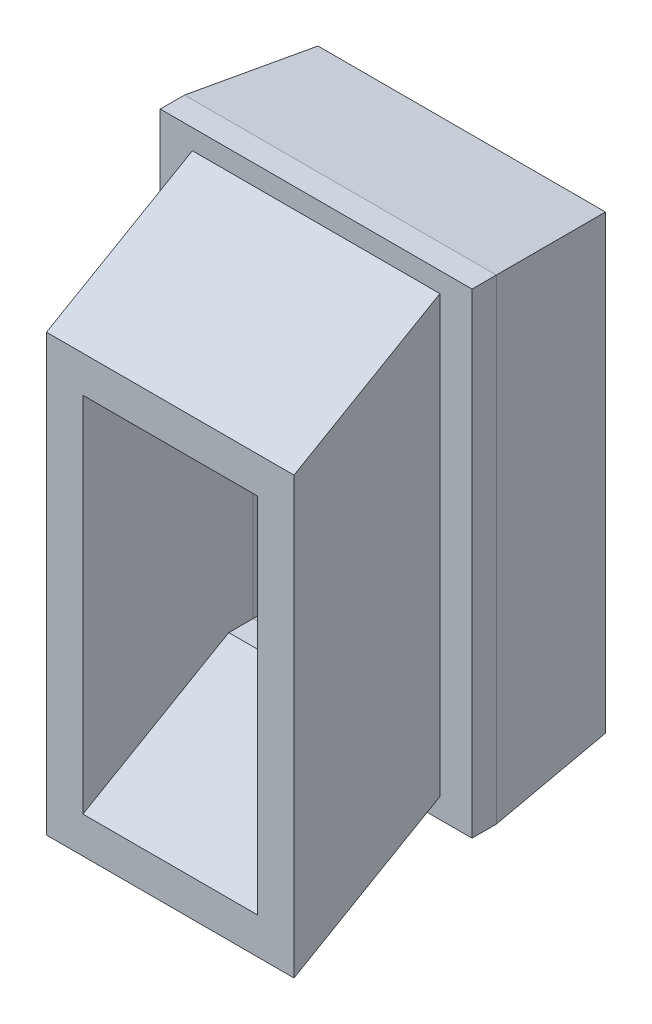
ISO-10303-21;
HEADER;
FILE_DESCRIPTION(('STEP AP214'),'2;1');
FILE_NAME('part.step','',(''),(''),'','','');
FILE_SCHEMA(('AUTOMOTIVE_DESIGN { 1 0 10303 214 1 1 1 1 }'));
ENDSEC;
DATA;
#1=APPLICATION_CONTEXT('core data for automotive mechanical design processes');
#2=APPLICATION_PROTOCOL_DEFINITION('international standard','automotive_design',2000,#1);
#3=PRODUCT_CONTEXT('',#1,'mechanical');
#4=PRODUCT('Part','Part','',(#3));
#5=PRODUCT_RELATED_PRODUCT_CATEGORY('part','',(#4));
#6=PRODUCT_DEFINITION_FORMATION('','',#4);
#7=PRODUCT_DEFINITION_CONTEXT('part definition',#1,'design');
#8=PRODUCT_DEFINITION('design','',#6,#7);
#9=PRODUCT_DEFINITION_SHAPE('','',#8);
#10=(LENGTH_UNIT() NAMED_UNIT(*) SI_UNIT(.MILLI.,.METRE.));
#11=(NAMED_UNIT(*) PLANE_ANGLE_UNIT() SI_UNIT($,.RADIAN.));
#12=(NAMED_UNIT(*) SI_UNIT($,.STERADIAN.) SOLID_ANGLE_UNIT());
#13=UNCERTAINTY_MEASURE_WITH_UNIT(LENGTH_MEASURE(1.E-05),#10,'distance_accuracy_value','');
#14=(GEOMETRIC_REPRESENTATION_CONTEXT(3) GLOBAL_UNCERTAINTY_ASSIGNED_CONTEXT((#13)) GLOBAL_UNIT_ASSIGNED_CONTEXT((#10,
#11,#12)) REPRESENTATION_CONTEXT('',''));
#15=CARTESIAN_POINT('',(0.,0.,0.));
#16=DIRECTION('',(0.,0.,1.));
#17=DIRECTION('',(1.,0.,0.));
#18=AXIS2_PLACEMENT_3D('',#15,#16,#17);
#19=CARTESIAN_POINT('',(0.,0.,12.));
#20=DIRECTION('',(0.,0.,-1.));
#21=DIRECTION('',(-1.,0.,0.));
#22=AXIS2_PLACEMENT_3D('',#19,#20,#21);
#23=PLANE('',#22);
#24=DIRECTION('',(0.,-1.,0.));
#25=VECTOR('',#24,1.);
#26=CARTESIAN_POINT('',(0.,0.,12.));
#27=LINE('',#26,#25);
#28=CARTESIAN_POINT('',(0.,39.2,12.));
#29=VERTEX_POINT('',#28);
#30=CARTESIAN_POINT('',(0.,0.,12.));
#31=VERTEX_POINT('',#30);
#32=EDGE_CURVE('E207',#29,#31,#27,.T.);
#33=ORIENTED_EDGE('',*,*,#32,.T.);
#34=DIRECTION('',(1.,0.,0.));
#35=VECTOR('',#34,1.);
#36=CARTESIAN_POINT('',(0.,0.,12.));
#37=LINE('',#36,#35);
#38=CARTESIAN_POINT('',(25.7,0.,12.));
#39=VERTEX_POINT('',#38);
#40=EDGE_CURVE('E210',#31,#39,#37,.T.);
#41=ORIENTED_EDGE('',*,*,#40,.T.);
#42=DIRECTION('',(0.,1.,0.));
#43=VECTOR('',#42,1.);
#44=CARTESIAN_POINT('',(25.7,0.,12.));
#45=LINE('',#44,#43);
#46=CARTESIAN_POINT('',(25.7,39.2,12.));
#47=VERTEX_POINT('',#46);
#48=EDGE_CURVE('E212',#39,#47,#45,.T.);
#49=ORIENTED_EDGE('',*,*,#48,.T.);
#50=DIRECTION('',(-1.,0.,0.));
#51=VECTOR('',#50,1.);
#52=CARTESIAN_POINT('',(0.,39.2,12.));
#53=LINE('',#52,#51);
#54=EDGE_CURVE('E214',#47,#29,#53,.T.);
#55=ORIENTED_EDGE('',*,*,#54,.T.);
#56=EDGE_LOOP('',(#33,#41,#49,#55));
#57=FACE_BOUND('',#56,.T.);
#58=DIRECTION('',(0.,-1.,0.));
#59=VECTOR('',#58,1.);
#60=CARTESIAN_POINT('',(2.64999999999999,1.65,12.));
#61=LINE('',#60,#59);
#62=CARTESIAN_POINT('',(2.64999999999999,37.55,12.));
#63=VERTEX_POINT('',#62);
#64=CARTESIAN_POINT('',(2.64999999999999,1.65,12.));
#65=VERTEX_POINT('',#64);
#66=EDGE_CURVE('E50',#63,#65,#61,.T.);
#67=ORIENTED_EDGE('',*,*,#66,.F.);
#68=DIRECTION('',(-1.,0.,0.));
#69=VECTOR('',#68,1.);
#70=CARTESIAN_POINT('',(2.64999999999999,37.55,12.));
#71=LINE('',#70,#69);
#72=CARTESIAN_POINT('',(23.05,37.55,12.));
#73=VERTEX_POINT('',#72);
#74=EDGE_CURVE('E54',#73,#63,#71,.T.);
#75=ORIENTED_EDGE('',*,*,#74,.F.);
#76=DIRECTION('',(0.,1.,0.));
#77=VECTOR('',#76,1.);
#78=CARTESIAN_POINT('',(23.05,37.55,12.));
#79=LINE('',#78,#77);
#80=CARTESIAN_POINT('',(23.05,1.65,12.));
#81=VERTEX_POINT('',#80);
#82=EDGE_CURVE('E562',#81,#73,#79,.T.);
#83=ORIENTED_EDGE('',*,*,#82,.F.);
#84=DIRECTION('',(1.,0.,0.));
#85=VECTOR('',#84,1.);
#86=CARTESIAN_POINT('',(2.64999999999999,1.65,12.));
#87=LINE('',#86,#85);
#88=EDGE_CURVE('E560',#65,#81,#87,.T.);
#89=ORIENTED_EDGE('',*,*,#88,.F.);
#90=EDGE_LOOP('',(#67,#75,#83,#89));
#91=FACE_BOUND('',#90,.T.);
#92=ADVANCED_FACE('F33',(#57,#91),#23,.F.);
#93=CARTESIAN_POINT('',(0.,0.,0.));
#94=DIRECTION('',(0.,0.,-1.));
#95=DIRECTION('',(-1.,0.,0.));
#96=AXIS2_PLACEMENT_3D('',#93,#94,#95);
#97=PLANE('',#96);
#98=DIRECTION('',(0.,-1.,0.));
#99=VECTOR('',#98,1.);
#100=CARTESIAN_POINT('',(4.64999999999999,0.,0.));
#101=LINE('',#100,#99);
#102=CARTESIAN_POINT('',(4.64999999999999,35.55,0.));
#103=VERTEX_POINT('',#102);
#104=CARTESIAN_POINT('',(4.64999999999999,3.65,0.));
#105=VERTEX_POINT('',#104);
#106=EDGE_CURVE('E237',#103,#105,#101,.T.);
#107=ORIENTED_EDGE('',*,*,#106,.T.);
#108=DIRECTION('',(1.,0.,0.));
#109=VECTOR('',#108,1.);
#110=CARTESIAN_POINT('',(0.,3.65,0.));
#111=LINE('',#110,#109);
#112=CARTESIAN_POINT('',(21.05,3.65,0.));
#113=VERTEX_POINT('',#112);
#114=EDGE_CURVE('E243',#105,#113,#111,.T.);
#115=ORIENTED_EDGE('',*,*,#114,.T.);
#116=DIRECTION('',(0.,1.,0.));
#117=VECTOR('',#116,1.);
#118=CARTESIAN_POINT('',(21.05,0.,0.));
#119=LINE('',#118,#117);
#120=CARTESIAN_POINT('',(21.05,35.55,0.));
#121=VERTEX_POINT('',#120);
#122=EDGE_CURVE('E241',#113,#121,#119,.T.);
#123=ORIENTED_EDGE('',*,*,#122,.T.);
#124=DIRECTION('',(-1.,0.,0.));
#125=VECTOR('',#124,1.);
#126=CARTESIAN_POINT('',(0.,35.55,0.));
#127=LINE('',#126,#125);
#128=EDGE_CURVE('E239',#121,#103,#127,.T.);
#129=ORIENTED_EDGE('',*,*,#128,.T.);
#130=EDGE_LOOP('',(#107,#115,#123,#129));
#131=FACE_BOUND('',#130,.T.);
#132=DIRECTION('',(1.,0.,0.));
#133=VECTOR('',#132,1.);
#134=CARTESIAN_POINT('',(25.7,38.2,0.));
#135=LINE('',#134,#133);
#136=CARTESIAN_POINT('',(0.999999999999997,38.2,0.));
#137=VERTEX_POINT('',#136);
#138=CARTESIAN_POINT('',(24.7,38.2,0.));
#139=VERTEX_POINT('',#138);
#140=EDGE_CURVE('E232',#137,#139,#135,.T.);
#141=ORIENTED_EDGE('',*,*,#140,.T.);
#142=DIRECTION('',(0.,-1.,0.));
#143=VECTOR('',#142,1.);
#144=CARTESIAN_POINT('',(24.7,0.,0.));
#145=LINE('',#144,#143);
#146=CARTESIAN_POINT('',(24.7,1.,0.));
#147=VERTEX_POINT('',#146);
#148=EDGE_CURVE('E234',#139,#147,#145,.T.);
#149=ORIENTED_EDGE('',*,*,#148,.T.);
#150=DIRECTION('',(-1.,0.,0.));
#151=VECTOR('',#150,1.);
#152=CARTESIAN_POINT('',(0.,1.,0.));
#153=LINE('',#152,#151);
#154=CARTESIAN_POINT('',(1.,1.,0.));
#155=VERTEX_POINT('',#154);
#156=EDGE_CURVE('E228',#147,#155,#153,.T.);
#157=ORIENTED_EDGE('',*,*,#156,.T.);
#158=DIRECTION('',(0.,1.,0.));
#159=VECTOR('',#158,1.);
#160=CARTESIAN_POINT('',(0.999999999999997,39.2,0.));
#161=LINE('',#160,#159);
#162=EDGE_CURVE('E230',#155,#137,#161,.T.);
#163=ORIENTED_EDGE('',*,*,#162,.T.);
#164=EDGE_LOOP('',(#141,#149,#157,#163));
#165=FACE_BOUND('',#164,.T.);
#166=ADVANCED_FACE('F291',(#131,#165),#97,.T.);
#167=CARTESIAN_POINT('',(0.,0.,12.));
#168=DIRECTION('',(1.,0.,0.));
#169=DIRECTION('',(0.,1.,0.));
#170=AXIS2_PLACEMENT_3D('',#167,#168,#169);
#171=PLANE('',#170);
#172=DIRECTION('',(0.,0.,-1.));
#173=VECTOR('',#172,1.);
#174=CARTESIAN_POINT('',(0.,39.2,12.));
#175=LINE('',#174,#173);
#176=CARTESIAN_POINT('',(0.,39.2,10.0000000000004));
#177=VERTEX_POINT('',#176);
#178=EDGE_CURVE('E216',#29,#177,#175,.T.);
#179=ORIENTED_EDGE('',*,*,#178,.T.);
#180=DIRECTION('',(0.,-1.,0.));
#181=VECTOR('',#180,1.);
#182=CARTESIAN_POINT('',(0.,0.,10.0000000000004));
#183=LINE('',#182,#181);
#184=CARTESIAN_POINT('',(0.,0.,10.0000000000004));
#185=VERTEX_POINT('',#184);
#186=EDGE_CURVE('E42',#177,#185,#183,.T.);
#187=ORIENTED_EDGE('',*,*,#186,.T.);
#188=DIRECTION('',(0.,0.,-1.));
#189=VECTOR('',#188,1.);
#190=CARTESIAN_POINT('',(0.,0.,12.));
#191=LINE('',#190,#189);
#192=EDGE_CURVE('E225',#31,#185,#191,.T.);
#193=ORIENTED_EDGE('',*,*,#192,.F.);
#194=ORIENTED_EDGE('',*,*,#32,.F.);
#195=EDGE_LOOP('',(#179,#187,#193,#194));
#196=FACE_BOUND('',#195,.T.);
#197=ADVANCED_FACE('F313',(#196),#171,.F.);
#198=CARTESIAN_POINT('',(0.,0.,12.));
#199=DIRECTION('',(0.,1.,0.));
#200=DIRECTION('',(0.,0.,1.));
#201=AXIS2_PLACEMENT_3D('',#198,#199,#200);
#202=PLANE('',#201);
#203=ORIENTED_EDGE('',*,*,#192,.T.);
#204=DIRECTION('',(1.,0.,0.));
#205=VECTOR('',#204,1.);
#206=CARTESIAN_POINT('',(25.7,0.,10.0000000000004));
#207=LINE('',#206,#205);
#208=CARTESIAN_POINT('',(25.7,0.,10.0000000000004));
#209=VERTEX_POINT('',#208);
#210=EDGE_CURVE('E11',#185,#209,#207,.T.);
#211=ORIENTED_EDGE('',*,*,#210,.T.);
#212=DIRECTION('',(0.,0.,-1.));
#213=VECTOR('',#212,1.);
#214=CARTESIAN_POINT('',(25.7,0.,12.));
#215=LINE('',#214,#213);
#216=EDGE_CURVE('E222',#39,#209,#215,.T.);
#217=ORIENTED_EDGE('',*,*,#216,.F.);
#218=ORIENTED_EDGE('',*,*,#40,.F.);
#219=EDGE_LOOP('',(#203,#211,#217,#218));
#220=FACE_BOUND('',#219,.T.);
#221=ADVANCED_FACE('F311',(#220),#202,.F.);
#222=CARTESIAN_POINT('',(25.7,0.,12.));
#223=DIRECTION('',(-1.,0.,0.));
#224=DIRECTION('',(0.,-1.,0.));
#225=AXIS2_PLACEMENT_3D('',#222,#223,#224);
#226=PLANE('',#225);
#227=ORIENTED_EDGE('',*,*,#216,.T.);
#228=DIRECTION('',(0.,1.,0.));
#229=VECTOR('',#228,1.);
#230=CARTESIAN_POINT('',(25.7,39.2,10.0000000000004));
#231=LINE('',#230,#229);
#232=CARTESIAN_POINT('',(25.7,39.2,10.0000000000004));
#233=VERTEX_POINT('',#232);
#234=EDGE_CURVE('E255',#209,#233,#231,.T.);
#235=ORIENTED_EDGE('',*,*,#234,.T.);
#236=DIRECTION('',(0.,0.,-1.));
#237=VECTOR('',#236,1.);
#238=CARTESIAN_POINT('',(25.7,39.2,12.));
#239=LINE('',#238,#237);
#240=EDGE_CURVE('E219',#47,#233,#239,.T.);
#241=ORIENTED_EDGE('',*,*,#240,.F.);
#242=ORIENTED_EDGE('',*,*,#48,.F.);
#243=EDGE_LOOP('',(#227,#235,#241,#242));
#244=FACE_BOUND('',#243,.T.);
#245=ADVANCED_FACE('F302',(#244),#226,.F.);
#246=CARTESIAN_POINT('',(0.,39.2,12.));
#247=DIRECTION('',(0.,-1.,0.));
#248=DIRECTION('',(0.,0.,-1.));
#249=AXIS2_PLACEMENT_3D('',#246,#247,#248);
#250=PLANE('',#249);
#251=ORIENTED_EDGE('',*,*,#240,.T.);
#252=DIRECTION('',(-1.,0.,0.));
#253=VECTOR('',#252,1.);
#254=CARTESIAN_POINT('',(0.,39.2,10.0000000000004));
#255=LINE('',#254,#253);
#256=EDGE_CURVE('E258',#233,#177,#255,.T.);
#257=ORIENTED_EDGE('',*,*,#256,.T.);
#258=ORIENTED_EDGE('',*,*,#178,.F.);
#259=ORIENTED_EDGE('',*,*,#54,.F.);
#260=EDGE_LOOP('',(#251,#257,#258,#259));
#261=FACE_BOUND('',#260,.T.);
#262=ADVANCED_FACE('F306',(#261),#250,.F.);
#263=CARTESIAN_POINT('',(5.64999999999999,4.65,12.));
#264=DIRECTION('',(1.,0.,0.));
#265=DIRECTION('',(0.,0.,-1.));
#266=AXIS2_PLACEMENT_3D('',#263,#264,#265);
#267=PLANE('',#266);
#268=DIRECTION('',(0.,0.,-1.));
#269=VECTOR('',#268,1.);
#270=CARTESIAN_POINT('',(5.64999999999999,4.65,12.));
#271=LINE('',#270,#269);
#272=CARTESIAN_POINT('',(5.64999999999999,4.65,12.));
#273=VERTEX_POINT('',#272);
#274=CARTESIAN_POINT('',(5.64999999999999,4.65,10.));
#275=VERTEX_POINT('',#274);
#276=EDGE_CURVE('E204',#273,#275,#271,.T.);
#277=ORIENTED_EDGE('',*,*,#276,.T.);
#278=DIRECTION('',(0.,1.,0.));
#279=VECTOR('',#278,1.);
#280=CARTESIAN_POINT('',(5.64999999999999,4.65,10.));
#281=LINE('',#280,#279);
#282=CARTESIAN_POINT('',(5.64999999999999,34.55,10.));
#283=VERTEX_POINT('',#282);
#284=EDGE_CURVE('E253',#275,#283,#281,.T.);
#285=ORIENTED_EDGE('',*,*,#284,.T.);
#286=DIRECTION('',(0.,0.,-1.));
#287=VECTOR('',#286,1.);
#288=CARTESIAN_POINT('',(5.64999999999999,34.55,12.));
#289=LINE('',#288,#287);
#290=CARTESIAN_POINT('',(5.64999999999999,34.55,12.));
#291=VERTEX_POINT('',#290);
#292=EDGE_CURVE('E195',#291,#283,#289,.T.);
#293=ORIENTED_EDGE('',*,*,#292,.F.);
#294=DIRECTION('',(0.,0.500000000000004,-0.866025403784436));
#295=VECTOR('',#294,1.);
#296=CARTESIAN_POINT('',(5.64999999999999,27.6077863452328,24.024266767055));
#297=LINE('',#296,#295);
#298=CARTESIAN_POINT('',(5.64999999999999,27.6077863452328,24.024266767055));
#299=VERTEX_POINT('',#298);
#300=EDGE_CURVE('E180',#299,#291,#297,.T.);
#301=ORIENTED_EDGE('',*,*,#300,.F.);
#302=DIRECTION('',(0.,-1.,0.));
#303=VECTOR('',#302,1.);
#304=CARTESIAN_POINT('',(5.64999999999999,-2.29221365476717,24.024266767055));
#305=LINE('',#304,#303);
#306=CARTESIAN_POINT('',(5.64999999999999,-2.29221365476717,24.024266767055));
#307=VERTEX_POINT('',#306);
#308=EDGE_CURVE('E548',#299,#307,#305,.T.);
#309=ORIENTED_EDGE('',*,*,#308,.T.);
#310=DIRECTION('',(0.,0.500000000000004,-0.866025403784436));
#311=VECTOR('',#310,1.);
#312=CARTESIAN_POINT('',(5.64999999999999,-2.29221365476717,24.024266767055));
#313=LINE('',#312,#311);
#314=EDGE_CURVE('E182',#307,#273,#313,.T.);
#315=ORIENTED_EDGE('',*,*,#314,.T.);
#316=EDGE_LOOP('',(#277,#285,#293,#301,#309,#315));
#317=FACE_BOUND('',#316,.T.);
#318=ADVANCED_FACE('F331',(#317),#267,.T.);
#319=CARTESIAN_POINT('',(5.64999999999999,4.65,12.));
#320=DIRECTION('',(0.,1.,0.));
#321=DIRECTION('',(0.,0.,1.));
#322=AXIS2_PLACEMENT_3D('',#319,#320,#321);
#323=PLANE('',#322);
#324=DIRECTION('',(0.,0.,-1.));
#325=VECTOR('',#324,1.);
#326=CARTESIAN_POINT('',(20.05,4.65,12.));
#327=LINE('',#326,#325);
#328=CARTESIAN_POINT('',(20.05,4.65,12.));
#329=VERTEX_POINT('',#328);
#330=CARTESIAN_POINT('',(20.05,4.65,10.));
#331=VERTEX_POINT('',#330);
#332=EDGE_CURVE('E201',#329,#331,#327,.T.);
#333=ORIENTED_EDGE('',*,*,#332,.T.);
#334=DIRECTION('',(-1.,0.,0.));
#335=VECTOR('',#334,1.);
#336=CARTESIAN_POINT('',(5.64999999999999,4.65,10.));
#337=LINE('',#336,#335);
#338=EDGE_CURVE('E246',#331,#275,#337,.T.);
#339=ORIENTED_EDGE('',*,*,#338,.T.);
#340=ORIENTED_EDGE('',*,*,#276,.F.);
#341=DIRECTION('',(1.,0.,0.));
#342=VECTOR('',#341,1.);
#343=CARTESIAN_POINT('',(5.64999999999999,4.65,12.));
#344=LINE('',#343,#342);
#345=EDGE_CURVE('E188',#273,#329,#344,.T.);
#346=ORIENTED_EDGE('',*,*,#345,.T.);
#347=EDGE_LOOP('',(#333,#339,#340,#346));
#348=FACE_BOUND('',#347,.T.);
#349=ADVANCED_FACE('F491',(#348),#323,.T.);
#350=CARTESIAN_POINT('',(20.05,4.65,12.));
#351=DIRECTION('',(-1.,0.,0.));
#352=DIRECTION('',(0.,0.,1.));
#353=AXIS2_PLACEMENT_3D('',#350,#351,#352);
#354=PLANE('',#353);
#355=DIRECTION('',(0.,0.,-1.));
#356=VECTOR('',#355,1.);
#357=CARTESIAN_POINT('',(20.05,34.55,12.));
#358=LINE('',#357,#356);
#359=CARTESIAN_POINT('',(20.05,34.55,12.));
#360=VERTEX_POINT('',#359);
#361=CARTESIAN_POINT('',(20.05,34.55,10.));
#362=VERTEX_POINT('',#361);
#363=EDGE_CURVE('E198',#360,#362,#358,.T.);
#364=ORIENTED_EDGE('',*,*,#363,.T.);
#365=DIRECTION('',(0.,-1.,0.));
#366=VECTOR('',#365,1.);
#367=CARTESIAN_POINT('',(20.05,4.65,10.));
#368=LINE('',#367,#366);
#369=EDGE_CURVE('E249',#362,#331,#368,.T.);
#370=ORIENTED_EDGE('',*,*,#369,.T.);
#371=ORIENTED_EDGE('',*,*,#332,.F.);
#372=DIRECTION('',(0.,0.500000000000004,-0.866025403784436));
#373=VECTOR('',#372,1.);
#374=CARTESIAN_POINT('',(20.05,-2.29221365476717,24.024266767055));
#375=LINE('',#374,#373);
#376=CARTESIAN_POINT('',(20.05,-2.29221365476717,24.024266767055));
#377=VERTEX_POINT('',#376);
#378=EDGE_CURVE('E566',#377,#329,#375,.T.);
#379=ORIENTED_EDGE('',*,*,#378,.F.);
#380=DIRECTION('',(0.,1.,0.));
#381=VECTOR('',#380,1.);
#382=CARTESIAN_POINT('',(20.05,27.6077863452328,24.024266767055));
#383=LINE('',#382,#381);
#384=CARTESIAN_POINT('',(20.05,27.6077863452328,24.024266767055));
#385=VERTEX_POINT('',#384);
#386=EDGE_CURVE('E555',#377,#385,#383,.T.);
#387=ORIENTED_EDGE('',*,*,#386,.T.);
#388=DIRECTION('',(0.,0.500000000000004,-0.866025403784436));
#389=VECTOR('',#388,1.);
#390=CARTESIAN_POINT('',(20.05,27.6077863452328,24.024266767055));
#391=LINE('',#390,#389);
#392=EDGE_CURVE('E273',#385,#360,#391,.T.);
#393=ORIENTED_EDGE('',*,*,#392,.T.);
#394=EDGE_LOOP('',(#364,#370,#371,#379,#387,#393));
#395=FACE_BOUND('',#394,.T.);
#396=ADVANCED_FACE('F485',(#395),#354,.T.);
#397=CARTESIAN_POINT('',(5.64999999999999,34.55,12.));
#398=DIRECTION('',(0.,-1.,0.));
#399=DIRECTION('',(0.,0.,-1.));
#400=AXIS2_PLACEMENT_3D('',#397,#398,#399);
#401=PLANE('',#400);
#402=ORIENTED_EDGE('',*,*,#292,.T.);
#403=DIRECTION('',(1.,0.,0.));
#404=VECTOR('',#403,1.);
#405=CARTESIAN_POINT('',(5.64999999999999,34.55,10.));
#406=LINE('',#405,#404);
#407=EDGE_CURVE('E251',#283,#362,#406,.T.);
#408=ORIENTED_EDGE('',*,*,#407,.T.);
#409=ORIENTED_EDGE('',*,*,#363,.F.);
#410=DIRECTION('',(-1.,0.,0.));
#411=VECTOR('',#410,1.);
#412=CARTESIAN_POINT('',(5.64999999999999,34.55,12.));
#413=LINE('',#412,#411);
#414=EDGE_CURVE('E191',#360,#291,#413,.T.);
#415=ORIENTED_EDGE('',*,*,#414,.T.);
#416=EDGE_LOOP('',(#402,#408,#409,#415));
#417=FACE_BOUND('',#416,.T.);
#418=ADVANCED_FACE('F355',(#417),#401,.T.);
#419=CARTESIAN_POINT('',(0.,35.55,0.));
#420=DIRECTION('',(0.,0.995037190209989,0.099503719020999));
#421=DIRECTION('',(-1.,0.,0.));
#422=AXIS2_PLACEMENT_3D('',#419,#420,#421);
#423=PLANE('',#422);
#424=DIRECTION('',(-0.0990147542976675,-0.0990147542976675,0.990147542976675));
#425=VECTOR('',#424,1.);
#426=CARTESIAN_POINT('',(20.7014705882353,35.2014705882353,3.48529411764706));
#427=LINE('',#426,#425);
#428=EDGE_CURVE('E265',#362,#121,#427,.F.);
#429=ORIENTED_EDGE('',*,*,#428,.F.);
#430=ORIENTED_EDGE('',*,*,#407,.F.);
#431=DIRECTION('',(0.0990147542976675,-0.0990147542976675,0.990147542976675));
#432=VECTOR('',#431,1.);
#433=CARTESIAN_POINT('',(4.60441176470588,35.5955882352941,-0.455882352941176));
#434=LINE('',#433,#432);
#435=EDGE_CURVE('E192',#103,#283,#434,.T.);
#436=ORIENTED_EDGE('',*,*,#435,.F.);
#437=ORIENTED_EDGE('',*,*,#128,.F.);
#438=EDGE_LOOP('',(#429,#430,#436,#437));
#439=FACE_BOUND('',#438,.T.);
#440=ADVANCED_FACE('F349',(#439),#423,.F.);
#441=CARTESIAN_POINT('',(4.64999999999999,0.,0.));
#442=DIRECTION('',(-0.995037190209989,0.,0.0995037190209989));
#443=DIRECTION('',(0.,-1.,0.));
#444=AXIS2_PLACEMENT_3D('',#441,#442,#443);
#445=PLANE('',#444);
#446=ORIENTED_EDGE('',*,*,#435,.T.);
#447=ORIENTED_EDGE('',*,*,#284,.F.);
#448=DIRECTION('',(-0.0990147542976675,-0.0990147542976675,-0.990147542976675));
#449=VECTOR('',#448,1.);
#450=CARTESIAN_POINT('',(4.60441176470588,3.60441176470588,-0.455882352941176));
#451=LINE('',#450,#449);
#452=EDGE_CURVE('E263',#105,#275,#451,.F.);
#453=ORIENTED_EDGE('',*,*,#452,.F.);
#454=ORIENTED_EDGE('',*,*,#106,.F.);
#455=EDGE_LOOP('',(#446,#447,#453,#454));
#456=FACE_BOUND('',#455,.T.);
#457=ADVANCED_FACE('F354',(#456),#445,.F.);
#458=CARTESIAN_POINT('',(21.05,0.,0.));
#459=DIRECTION('',(0.995037190209989,0.,0.099503719020999));
#460=DIRECTION('',(0.,1.,0.));
#461=AXIS2_PLACEMENT_3D('',#458,#459,#460);
#462=PLANE('',#461);
#463=ORIENTED_EDGE('',*,*,#428,.T.);
#464=ORIENTED_EDGE('',*,*,#122,.F.);
#465=DIRECTION('',(-0.0990147542976675,0.0990147542976675,0.990147542976675));
#466=VECTOR('',#465,1.);
#467=CARTESIAN_POINT('',(20.8436274509804,3.85637254901961,2.06372549019608));
#468=LINE('',#467,#466);
#469=EDGE_CURVE('E261',#331,#113,#468,.F.);
#470=ORIENTED_EDGE('',*,*,#469,.F.);
#471=ORIENTED_EDGE('',*,*,#369,.F.);
#472=EDGE_LOOP('',(#463,#464,#470,#471));
#473=FACE_BOUND('',#472,.T.);
#474=ADVANCED_FACE('F367',(#473),#462,.F.);
#475=CARTESIAN_POINT('',(0.,3.65,0.));
#476=DIRECTION('',(0.,-0.995037190209989,0.0995037190209989));
#477=DIRECTION('',(1.,0.,0.));
#478=AXIS2_PLACEMENT_3D('',#475,#476,#477);
#479=PLANE('',#478);
#480=ORIENTED_EDGE('',*,*,#452,.T.);
#481=ORIENTED_EDGE('',*,*,#338,.F.);
#482=ORIENTED_EDGE('',*,*,#469,.T.);
#483=ORIENTED_EDGE('',*,*,#114,.F.);
#484=EDGE_LOOP('',(#480,#481,#482,#483));
#485=FACE_BOUND('',#484,.T.);
#486=ADVANCED_FACE('F377',(#485),#479,.F.);
#487=CARTESIAN_POINT('',(0.,0.,10.0000000000004));
#488=DIRECTION('',(-0.995037190209989,0.,-0.0995037190209955));
#489=DIRECTION('',(0.,1.,0.));
#490=AXIS2_PLACEMENT_3D('',#487,#488,#489);
#491=PLANE('',#490);
#492=DIRECTION('',(0.0990147542976641,-0.0990147542976641,-0.990147542976675));
#493=VECTOR('',#492,1.);
#494=CARTESIAN_POINT('',(0.384313725490167,38.8156862745098,6.15686274509852));
#495=LINE('',#494,#493);
#496=EDGE_CURVE('E274',#137,#177,#495,.F.);
#497=ORIENTED_EDGE('',*,*,#496,.F.);
#498=ORIENTED_EDGE('',*,*,#162,.F.);
#499=DIRECTION('',(0.0990147542976641,0.0990147542976641,-0.990147542976675));
#500=VECTOR('',#499,1.);
#501=CARTESIAN_POINT('',(0.,0.,10.0000000000004));
#502=LINE('',#501,#500);
#503=EDGE_CURVE('E37',#185,#155,#502,.T.);
#504=ORIENTED_EDGE('',*,*,#503,.F.);
#505=ORIENTED_EDGE('',*,*,#186,.F.);
#506=EDGE_LOOP('',(#497,#498,#504,#505));
#507=FACE_BOUND('',#506,.T.);
#508=ADVANCED_FACE('F35',(#507),#491,.T.);
#509=CARTESIAN_POINT('',(0.,0.,10.0000000000004));
#510=DIRECTION('',(0.,-0.995037190209989,-0.0995037190209955));
#511=DIRECTION('',(-1.,0.,0.));
#512=AXIS2_PLACEMENT_3D('',#509,#510,#511);
#513=PLANE('',#512);
#514=ORIENTED_EDGE('',*,*,#503,.T.);
#515=ORIENTED_EDGE('',*,*,#156,.F.);
#516=DIRECTION('',(0.0990147542976641,-0.0990147542976641,0.990147542976675));
#517=VECTOR('',#516,1.);
#518=CARTESIAN_POINT('',(25.4480392156863,0.251960784313708,7.48039215686318));
#519=LINE('',#518,#517);
#520=EDGE_CURVE('E272',#209,#147,#519,.F.);
#521=ORIENTED_EDGE('',*,*,#520,.F.);
#522=ORIENTED_EDGE('',*,*,#210,.F.);
#523=EDGE_LOOP('',(#514,#515,#521,#522));
#524=FACE_BOUND('',#523,.T.);
#525=ADVANCED_FACE('F285',(#524),#513,.T.);
#526=CARTESIAN_POINT('',(0.,39.2,10.0000000000004));
#527=DIRECTION('',(0.,0.995037190209989,-0.0995037190209955));
#528=DIRECTION('',(1.,0.,0.));
#529=AXIS2_PLACEMENT_3D('',#526,#527,#528);
#530=PLANE('',#529);
#531=ORIENTED_EDGE('',*,*,#496,.T.);
#532=ORIENTED_EDGE('',*,*,#256,.F.);
#533=DIRECTION('',(-0.0990147542976641,-0.0990147542976641,-0.990147542976675));
#534=VECTOR('',#533,1.);
#535=CARTESIAN_POINT('',(25.4480392156863,38.9480392156863,7.48039215686319));
#536=LINE('',#535,#534);
#537=EDGE_CURVE('E270',#139,#233,#536,.F.);
#538=ORIENTED_EDGE('',*,*,#537,.F.);
#539=ORIENTED_EDGE('',*,*,#140,.F.);
#540=EDGE_LOOP('',(#531,#532,#538,#539));
#541=FACE_BOUND('',#540,.T.);
#542=ADVANCED_FACE('F297',(#541),#530,.T.);
#543=CARTESIAN_POINT('',(25.7,0.,10.0000000000004));
#544=DIRECTION('',(0.995037190209989,0.,-0.0995037190209955));
#545=DIRECTION('',(0.,-1.,0.));
#546=AXIS2_PLACEMENT_3D('',#543,#544,#545);
#547=PLANE('',#546);
#548=ORIENTED_EDGE('',*,*,#520,.T.);
#549=ORIENTED_EDGE('',*,*,#148,.F.);
#550=ORIENTED_EDGE('',*,*,#537,.T.);
#551=ORIENTED_EDGE('',*,*,#234,.F.);
#552=EDGE_LOOP('',(#548,#549,#550,#551));
#553=FACE_BOUND('',#552,.T.);
#554=ADVANCED_FACE('F295',(#553),#547,.T.);
#555=CARTESIAN_POINT('',(5.64999999999999,27.6077863452328,24.024266767055));
#556=DIRECTION('',(0.,-0.866025403784436,-0.500000000000004));
#557=DIRECTION('',(0.,0.500000000000004,-0.866025403784436));
#558=AXIS2_PLACEMENT_3D('',#555,#556,#557);
#559=PLANE('',#558);
#560=ORIENTED_EDGE('',*,*,#414,.F.);
#561=ORIENTED_EDGE('',*,*,#392,.F.);
#562=DIRECTION('',(-1.,0.,0.));
#563=VECTOR('',#562,1.);
#564=CARTESIAN_POINT('',(5.64999999999999,27.6077863452328,24.024266767055));
#565=LINE('',#564,#563);
#566=EDGE_CURVE('E545',#385,#299,#565,.T.);
#567=ORIENTED_EDGE('',*,*,#566,.T.);
#568=ORIENTED_EDGE('',*,*,#300,.T.);
#569=EDGE_LOOP('',(#560,#561,#567,#568));
#570=FACE_BOUND('',#569,.T.);
#571=ADVANCED_FACE('F415',(#570),#559,.T.);
#572=CARTESIAN_POINT('',(20.05,-2.29221365476717,24.024266767055));
#573=DIRECTION('',(0.,0.866025403784436,0.500000000000004));
#574=DIRECTION('',(0.,-0.500000000000004,0.866025403784436));
#575=AXIS2_PLACEMENT_3D('',#572,#573,#574);
#576=PLANE('',#575);
#577=ORIENTED_EDGE('',*,*,#345,.F.);
#578=ORIENTED_EDGE('',*,*,#314,.F.);
#579=DIRECTION('',(1.,0.,0.));
#580=VECTOR('',#579,1.);
#581=CARTESIAN_POINT('',(20.05,-2.29221365476717,24.024266767055));
#582=LINE('',#581,#580);
#583=EDGE_CURVE('E551',#307,#377,#582,.T.);
#584=ORIENTED_EDGE('',*,*,#583,.T.);
#585=ORIENTED_EDGE('',*,*,#378,.T.);
#586=EDGE_LOOP('',(#577,#578,#584,#585));
#587=FACE_BOUND('',#586,.T.);
#588=ADVANCED_FACE('F424',(#587),#576,.T.);
#589=CARTESIAN_POINT('',(2.64999999999999,-5.29221365476717,24.024266767055));
#590=DIRECTION('',(1.,0.,0.));
#591=DIRECTION('',(0.,0.,-1.));
#592=AXIS2_PLACEMENT_3D('',#589,#590,#591);
#593=PLANE('',#592);
#594=ORIENTED_EDGE('',*,*,#66,.T.);
#595=DIRECTION('',(0.,0.500000000000004,-0.866025403784436));
#596=VECTOR('',#595,1.);
#597=CARTESIAN_POINT('',(2.64999999999999,-5.29221365476717,24.024266767055));
#598=LINE('',#597,#596);
#599=CARTESIAN_POINT('',(2.64999999999999,-5.29221365476717,24.024266767055));
#600=VERTEX_POINT('',#599);
#601=EDGE_CURVE('E162',#600,#65,#598,.T.);
#602=ORIENTED_EDGE('',*,*,#601,.F.);
#603=DIRECTION('',(0.,-1.,0.));
#604=VECTOR('',#603,1.);
#605=CARTESIAN_POINT('',(2.64999999999999,-5.29221365476717,24.024266767055));
#606=LINE('',#605,#604);
#607=CARTESIAN_POINT('',(2.64999999999999,30.6077863452328,24.024266767055));
#608=VERTEX_POINT('',#607);
#609=EDGE_CURVE('E168',#608,#600,#606,.T.);
#610=ORIENTED_EDGE('',*,*,#609,.F.);
#611=DIRECTION('',(0.,0.500000000000004,-0.866025403784436));
#612=VECTOR('',#611,1.);
#613=CARTESIAN_POINT('',(2.64999999999999,30.6077863452328,24.024266767055));
#614=LINE('',#613,#612);
#615=EDGE_CURVE('E550',#608,#63,#614,.T.);
#616=ORIENTED_EDGE('',*,*,#615,.T.);
#617=EDGE_LOOP('',(#594,#602,#610,#616));
#618=FACE_BOUND('',#617,.T.);
#619=ADVANCED_FACE('F179',(#618),#593,.F.);
#620=CARTESIAN_POINT('',(2.64999999999999,-5.29221365476717,24.024266767055));
#621=DIRECTION('',(0.,0.866025403784436,0.500000000000004));
#622=DIRECTION('',(0.,-0.500000000000004,0.866025403784436));
#623=AXIS2_PLACEMENT_3D('',#620,#621,#622);
#624=PLANE('',#623);
#625=ORIENTED_EDGE('',*,*,#88,.T.);
#626=DIRECTION('',(0.,0.500000000000004,-0.866025403784436));
#627=VECTOR('',#626,1.);
#628=CARTESIAN_POINT('',(23.05,-5.29221365476717,24.024266767055));
#629=LINE('',#628,#627);
#630=CARTESIAN_POINT('',(23.05,-5.29221365476717,24.024266767055));
#631=VERTEX_POINT('',#630);
#632=EDGE_CURVE('E164',#631,#81,#629,.T.);
#633=ORIENTED_EDGE('',*,*,#632,.F.);
#634=DIRECTION('',(1.,0.,0.));
#635=VECTOR('',#634,1.);
#636=CARTESIAN_POINT('',(2.64999999999999,-5.29221365476717,24.024266767055));
#637=LINE('',#636,#635);
#638=EDGE_CURVE('E157',#600,#631,#637,.T.);
#639=ORIENTED_EDGE('',*,*,#638,.F.);
#640=ORIENTED_EDGE('',*,*,#601,.T.);
#641=EDGE_LOOP('',(#625,#633,#639,#640));
#642=FACE_BOUND('',#641,.T.);
#643=ADVANCED_FACE('F160',(#642),#624,.F.);
#644=CARTESIAN_POINT('',(23.05,30.6077863452328,24.024266767055));
#645=DIRECTION('',(-1.,0.,0.));
#646=DIRECTION('',(0.,-1.,0.));
#647=AXIS2_PLACEMENT_3D('',#644,#645,#646);
#648=PLANE('',#647);
#649=ORIENTED_EDGE('',*,*,#82,.T.);
#650=DIRECTION('',(0.,0.500000000000004,-0.866025403784436));
#651=VECTOR('',#650,1.);
#652=CARTESIAN_POINT('',(23.05,30.6077863452328,24.024266767055));
#653=LINE('',#652,#651);
#654=CARTESIAN_POINT('',(23.05,30.6077863452328,24.024266767055));
#655=VERTEX_POINT('',#654);
#656=EDGE_CURVE('E184',#655,#73,#653,.T.);
#657=ORIENTED_EDGE('',*,*,#656,.F.);
#658=DIRECTION('',(0.,1.,0.));
#659=VECTOR('',#658,1.);
#660=CARTESIAN_POINT('',(23.05,30.6077863452328,24.024266767055));
#661=LINE('',#660,#659);
#662=EDGE_CURVE('E167',#631,#655,#661,.T.);
#663=ORIENTED_EDGE('',*,*,#662,.F.);
#664=ORIENTED_EDGE('',*,*,#632,.T.);
#665=EDGE_LOOP('',(#649,#657,#663,#664));
#666=FACE_BOUND('',#665,.T.);
#667=ADVANCED_FACE('F446',(#666),#648,.F.);
#668=CARTESIAN_POINT('',(2.64999999999999,30.6077863452328,24.024266767055));
#669=DIRECTION('',(0.,-0.866025403784436,-0.500000000000004));
#670=DIRECTION('',(0.,0.500000000000004,-0.866025403784436));
#671=AXIS2_PLACEMENT_3D('',#668,#669,#670);
#672=PLANE('',#671);
#673=ORIENTED_EDGE('',*,*,#74,.T.);
#674=ORIENTED_EDGE('',*,*,#615,.F.);
#675=DIRECTION('',(-1.,0.,0.));
#676=VECTOR('',#675,1.);
#677=CARTESIAN_POINT('',(2.64999999999999,30.6077863452328,24.024266767055));
#678=LINE('',#677,#676);
#679=EDGE_CURVE('E174',#655,#608,#678,.T.);
#680=ORIENTED_EDGE('',*,*,#679,.F.);
#681=ORIENTED_EDGE('',*,*,#656,.T.);
#682=EDGE_LOOP('',(#673,#674,#680,#681));
#683=FACE_BOUND('',#682,.T.);
#684=ADVANCED_FACE('F453',(#683),#672,.F.);
#685=CARTESIAN_POINT('',(0.,-6.94221365476717,24.024266767055));
#686=DIRECTION('',(0.,0.,-1.));
#687=DIRECTION('',(-1.,0.,0.));
#688=AXIS2_PLACEMENT_3D('',#685,#686,#687);
#689=PLANE('',#688);
#690=ORIENTED_EDGE('',*,*,#609,.T.);
#691=ORIENTED_EDGE('',*,*,#638,.T.);
#692=ORIENTED_EDGE('',*,*,#662,.T.);
#693=ORIENTED_EDGE('',*,*,#679,.T.);
#694=EDGE_LOOP('',(#690,#691,#692,#693));
#695=FACE_BOUND('',#694,.T.);
#696=ORIENTED_EDGE('',*,*,#566,.F.);
#697=ORIENTED_EDGE('',*,*,#386,.F.);
#698=ORIENTED_EDGE('',*,*,#583,.F.);
#699=ORIENTED_EDGE('',*,*,#308,.F.);
#700=EDGE_LOOP('',(#696,#697,#698,#699));
#701=FACE_BOUND('',#700,.T.);
#702=ADVANCED_FACE('F171',(#695,#701),#689,.F.);
#703=CLOSED_SHELL('',(#92,#166,#197,#221,#245,#262,#318,#349,#396,#418,#440,#457,#474,#486,#508,
#525,#542,#554,#571,#588,#619,#643,#667,#684,#702));
#704=MANIFOLD_SOLID_BREP('B2',#703);
#705=ADVANCED_BREP_SHAPE_REPRESENTATION('',(#18,#704),#14);
#706=SHAPE_DEFINITION_REPRESENTATION(#9,#705);
ENDSEC;
END-ISO-10303-21;
